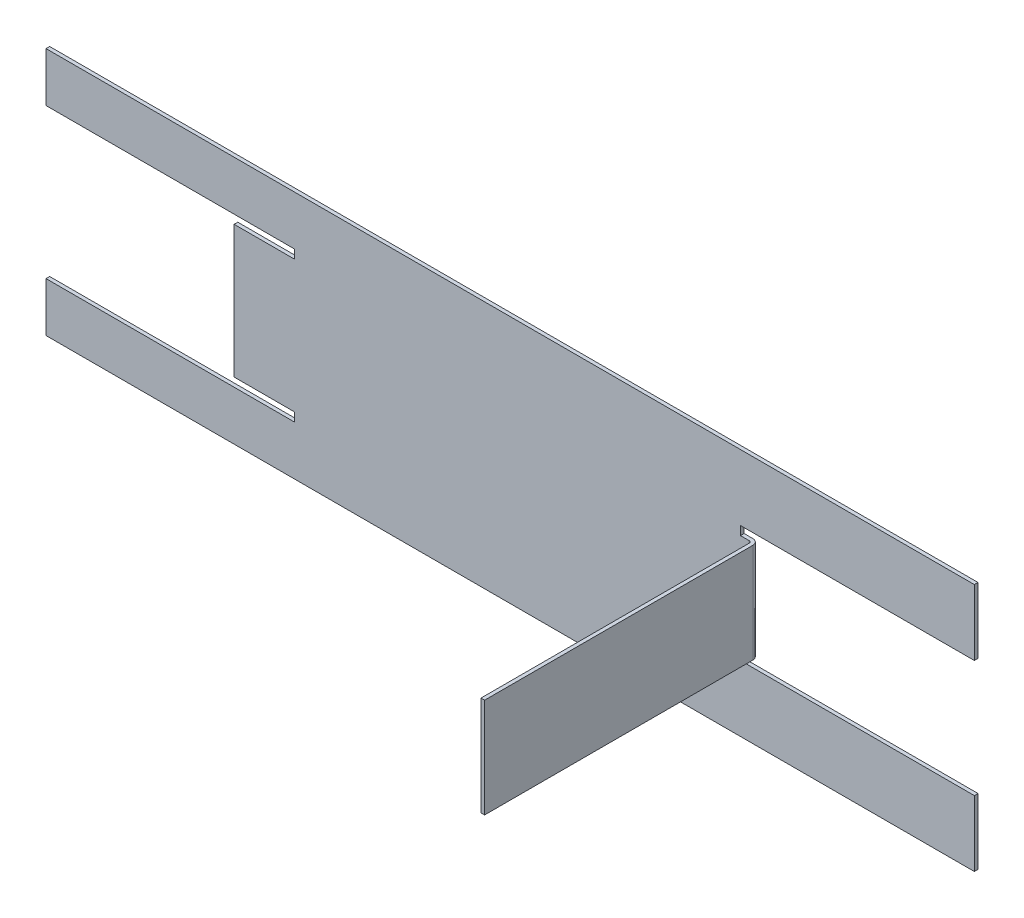
ISO-10303-21;
HEADER;
FILE_DESCRIPTION(('STEP AP214'),'2;1');
FILE_NAME('part.step','',(''),(''),'','','');
FILE_SCHEMA(('AUTOMOTIVE_DESIGN { 1 0 10303 214 1 1 1 1 }'));
ENDSEC;
DATA;
#1=APPLICATION_CONTEXT('core data for automotive mechanical design processes');
#2=APPLICATION_PROTOCOL_DEFINITION('international standard','automotive_design',2000,#1);
#3=PRODUCT_CONTEXT('',#1,'mechanical');
#4=PRODUCT('Part','Part','',(#3));
#5=PRODUCT_RELATED_PRODUCT_CATEGORY('part','',(#4));
#6=PRODUCT_DEFINITION_FORMATION('','',#4);
#7=PRODUCT_DEFINITION_CONTEXT('part definition',#1,'design');
#8=PRODUCT_DEFINITION('design','',#6,#7);
#9=PRODUCT_DEFINITION_SHAPE('','',#8);
#10=(LENGTH_UNIT() NAMED_UNIT(*) SI_UNIT(.MILLI.,.METRE.));
#11=(NAMED_UNIT(*) PLANE_ANGLE_UNIT() SI_UNIT($,.RADIAN.));
#12=(NAMED_UNIT(*) SI_UNIT($,.STERADIAN.) SOLID_ANGLE_UNIT());
#13=UNCERTAINTY_MEASURE_WITH_UNIT(LENGTH_MEASURE(1.E-05),#10,'distance_accuracy_value','');
#14=(GEOMETRIC_REPRESENTATION_CONTEXT(3) GLOBAL_UNCERTAINTY_ASSIGNED_CONTEXT((#13)) GLOBAL_UNIT_ASSIGNED_CONTEXT((#10,
#11,#12)) REPRESENTATION_CONTEXT('',''));
#15=CARTESIAN_POINT('',(0.,0.,0.));
#16=DIRECTION('',(0.,0.,1.));
#17=DIRECTION('',(1.,0.,0.));
#18=AXIS2_PLACEMENT_3D('',#15,#16,#17);
#19=CARTESIAN_POINT('',(0.,0.,-0.5));
#20=DIRECTION('',(0.,0.,-1.));
#21=DIRECTION('',(-1.,0.,0.));
#22=AXIS2_PLACEMENT_3D('',#19,#20,#21);
#23=PLANE('',#22);
#24=DIRECTION('',(-1.,0.,0.));
#25=VECTOR('',#24,1.);
#26=CARTESIAN_POINT('',(0.,6.8,-0.5));
#27=LINE('',#26,#25);
#28=CARTESIAN_POINT('',(31.5,6.8,-0.5));
#29=VERTEX_POINT('',#28);
#30=CARTESIAN_POINT('',(32.7,6.8,-0.499999999999999));
#31=VERTEX_POINT('',#30);
#32=EDGE_CURVE('E365',#29,#31,#27,.F.);
#33=ORIENTED_EDGE('',*,*,#32,.T.);
#34=DIRECTION('',(0.,1.,0.));
#35=VECTOR('',#34,1.);
#36=CARTESIAN_POINT('',(32.7,6.8,-0.499999999999999));
#37=LINE('',#36,#35);
#38=CARTESIAN_POINT('',(32.7,-6.8,-0.5));
#39=VERTEX_POINT('',#38);
#40=EDGE_CURVE('E334',#31,#39,#37,.F.);
#41=ORIENTED_EDGE('',*,*,#40,.T.);
#42=DIRECTION('',(-1.,0.,0.));
#43=VECTOR('',#42,1.);
#44=CARTESIAN_POINT('',(0.,-6.8,-0.5));
#45=LINE('',#44,#43);
#46=CARTESIAN_POINT('',(31.5,-6.8,-0.5));
#47=VERTEX_POINT('',#46);
#48=EDGE_CURVE('E385',#39,#47,#45,.T.);
#49=ORIENTED_EDGE('',*,*,#48,.T.);
#50=DIRECTION('',(0.,1.,0.));
#51=VECTOR('',#50,1.);
#52=CARTESIAN_POINT('',(31.5,0.,-0.5));
#53=LINE('',#52,#51);
#54=CARTESIAN_POINT('',(31.5,-8.,-0.5));
#55=VERTEX_POINT('',#54);
#56=EDGE_CURVE('E381',#47,#55,#53,.F.);
#57=ORIENTED_EDGE('',*,*,#56,.T.);
#58=DIRECTION('',(1.,0.,0.));
#59=VECTOR('',#58,1.);
#60=CARTESIAN_POINT('',(0.,-8.,-0.499999999999999));
#61=LINE('',#60,#59);
#62=CARTESIAN_POINT('',(63.5,-8.,-0.499999999999999));
#63=VERTEX_POINT('',#62);
#64=EDGE_CURVE('E409',#55,#63,#61,.T.);
#65=ORIENTED_EDGE('',*,*,#64,.T.);
#66=DIRECTION('',(0.,1.,0.));
#67=VECTOR('',#66,1.);
#68=CARTESIAN_POINT('',(63.5,17.,-0.5));
#69=LINE('',#68,#67);
#70=CARTESIAN_POINT('',(63.5,-17.,-0.5));
#71=VERTEX_POINT('',#70);
#72=EDGE_CURVE('E264',#71,#63,#69,.T.);
#73=ORIENTED_EDGE('',*,*,#72,.F.);
#74=DIRECTION('',(1.,0.,0.));
#75=VECTOR('',#74,1.);
#76=CARTESIAN_POINT('',(-63.5,-17.,-0.5));
#77=LINE('',#76,#75);
#78=CARTESIAN_POINT('',(-63.5,-17.,-0.5));
#79=VERTEX_POINT('',#78);
#80=EDGE_CURVE('E274',#79,#71,#77,.T.);
#81=ORIENTED_EDGE('',*,*,#80,.F.);
#82=DIRECTION('',(0.,-1.,0.));
#83=VECTOR('',#82,1.);
#84=CARTESIAN_POINT('',(-63.5,17.,-0.5));
#85=LINE('',#84,#83);
#86=CARTESIAN_POINT('',(-63.5,-10.25,-0.499999999999999));
#87=VERTEX_POINT('',#86);
#88=EDGE_CURVE('E429',#87,#79,#85,.T.);
#89=ORIENTED_EDGE('',*,*,#88,.F.);
#90=DIRECTION('',(-1.,0.,0.));
#91=VECTOR('',#90,1.);
#92=CARTESIAN_POINT('',(0.,-10.25,-0.499999999999999));
#93=LINE('',#92,#91);
#94=CARTESIAN_POINT('',(-29.5,-10.25,-0.5));
#95=VERTEX_POINT('',#94);
#96=EDGE_CURVE('E418',#95,#87,#93,.T.);
#97=ORIENTED_EDGE('',*,*,#96,.F.);
#98=DIRECTION('',(0.,1.,0.));
#99=VECTOR('',#98,1.);
#100=CARTESIAN_POINT('',(-29.5,0.,-0.5));
#101=LINE('',#100,#99);
#102=CARTESIAN_POINT('',(-29.5,-9.05,-0.5));
#103=VERTEX_POINT('',#102);
#104=EDGE_CURVE('E400',#95,#103,#101,.T.);
#105=ORIENTED_EDGE('',*,*,#104,.T.);
#106=DIRECTION('',(-1.,0.,0.));
#107=VECTOR('',#106,1.);
#108=CARTESIAN_POINT('',(0.,-9.05,-0.5));
#109=LINE('',#108,#107);
#110=CARTESIAN_POINT('',(-37.7639379797372,-9.05,-0.500000000000046));
#111=VERTEX_POINT('',#110);
#112=EDGE_CURVE('E397',#103,#111,#109,.T.);
#113=ORIENTED_EDGE('',*,*,#112,.T.);
#114=DIRECTION('',(0.,1.,0.));
#115=VECTOR('',#114,1.);
#116=CARTESIAN_POINT('',(-37.7639379797372,0.,-0.500000000000046));
#117=LINE('',#116,#115);
#118=CARTESIAN_POINT('',(-37.7639379797372,9.05,-0.500000000000046));
#119=VERTEX_POINT('',#118);
#120=EDGE_CURVE('E302',#111,#119,#117,.T.);
#121=ORIENTED_EDGE('',*,*,#120,.T.);
#122=DIRECTION('',(-1.,0.,0.));
#123=VECTOR('',#122,1.);
#124=CARTESIAN_POINT('',(0.,9.05,-0.5));
#125=LINE('',#124,#123);
#126=CARTESIAN_POINT('',(-29.5,9.05,-0.5));
#127=VERTEX_POINT('',#126);
#128=EDGE_CURVE('E353',#119,#127,#125,.F.);
#129=ORIENTED_EDGE('',*,*,#128,.T.);
#130=DIRECTION('',(0.,1.,0.));
#131=VECTOR('',#130,1.);
#132=CARTESIAN_POINT('',(-29.5,0.,-0.5));
#133=LINE('',#132,#131);
#134=CARTESIAN_POINT('',(-29.5,10.25,-0.5));
#135=VERTEX_POINT('',#134);
#136=EDGE_CURVE('E349',#127,#135,#133,.T.);
#137=ORIENTED_EDGE('',*,*,#136,.T.);
#138=DIRECTION('',(1.,0.,0.));
#139=VECTOR('',#138,1.);
#140=CARTESIAN_POINT('',(0.,10.25,-0.500000000000001));
#141=LINE('',#140,#139);
#142=CARTESIAN_POINT('',(-63.5,10.25,-0.500000000000001));
#143=VERTEX_POINT('',#142);
#144=EDGE_CURVE('E421',#143,#135,#141,.T.);
#145=ORIENTED_EDGE('',*,*,#144,.F.);
#146=CARTESIAN_POINT('',(-63.5,17.,-0.5));
#147=VERTEX_POINT('',#146);
#148=EDGE_CURVE('E279',#147,#143,#85,.T.);
#149=ORIENTED_EDGE('',*,*,#148,.F.);
#150=DIRECTION('',(-1.,0.,0.));
#151=VECTOR('',#150,1.);
#152=CARTESIAN_POINT('',(-63.5,17.,-0.5));
#153=LINE('',#152,#151);
#154=CARTESIAN_POINT('',(63.5,17.,-0.5));
#155=VERTEX_POINT('',#154);
#156=EDGE_CURVE('E271',#155,#147,#153,.T.);
#157=ORIENTED_EDGE('',*,*,#156,.F.);
#158=CARTESIAN_POINT('',(63.5,8.,-0.500000000000001));
#159=VERTEX_POINT('',#158);
#160=EDGE_CURVE('E255',#159,#155,#69,.T.);
#161=ORIENTED_EDGE('',*,*,#160,.F.);
#162=DIRECTION('',(1.,0.,0.));
#163=VECTOR('',#162,1.);
#164=CARTESIAN_POINT('',(0.,8.,-0.500000000000001));
#165=LINE('',#164,#163);
#166=CARTESIAN_POINT('',(31.5,8.,-0.5));
#167=VERTEX_POINT('',#166);
#168=EDGE_CURVE('E414',#167,#159,#165,.T.);
#169=ORIENTED_EDGE('',*,*,#168,.F.);
#170=DIRECTION('',(0.,1.,0.));
#171=VECTOR('',#170,1.);
#172=CARTESIAN_POINT('',(31.5,0.,-0.5));
#173=LINE('',#172,#171);
#174=EDGE_CURVE('E368',#167,#29,#173,.F.);
#175=ORIENTED_EDGE('',*,*,#174,.T.);
#176=EDGE_LOOP('',(#33,#41,#49,#57,#65,#73,#81,#89,#97,#105,#113,#121,#129,#137,#145,#149,#157,
#161,#169,#175));
#177=FACE_BOUND('',#176,.T.);
#178=ADVANCED_FACE('F94',(#177),#23,.T.);
#179=CARTESIAN_POINT('',(0.,0.,0.));
#180=DIRECTION('',(0.,0.,-1.));
#181=DIRECTION('',(-1.,0.,0.));
#182=AXIS2_PLACEMENT_3D('',#179,#180,#181);
#183=PLANE('',#182);
#184=DIRECTION('',(0.,1.,0.));
#185=VECTOR('',#184,1.);
#186=CARTESIAN_POINT('',(32.7,6.8,0.));
#187=LINE('',#186,#185);
#188=CARTESIAN_POINT('',(32.7,6.8,0.));
#189=VERTEX_POINT('',#188);
#190=CARTESIAN_POINT('',(32.7,-6.8,0.));
#191=VERTEX_POINT('',#190);
#192=EDGE_CURVE('E346',#189,#191,#187,.F.);
#193=ORIENTED_EDGE('',*,*,#192,.F.);
#194=DIRECTION('',(1.,0.,0.));
#195=VECTOR('',#194,1.);
#196=CARTESIAN_POINT('',(33.5,6.8,0.));
#197=LINE('',#196,#195);
#198=CARTESIAN_POINT('',(31.5,6.8,0.));
#199=VERTEX_POINT('',#198);
#200=EDGE_CURVE('E371',#199,#189,#197,.T.);
#201=ORIENTED_EDGE('',*,*,#200,.F.);
#202=DIRECTION('',(0.,-1.,0.));
#203=VECTOR('',#202,1.);
#204=CARTESIAN_POINT('',(31.5,8.,0.));
#205=LINE('',#204,#203);
#206=CARTESIAN_POINT('',(31.5,8.,0.));
#207=VERTEX_POINT('',#206);
#208=EDGE_CURVE('E364',#207,#199,#205,.T.);
#209=ORIENTED_EDGE('',*,*,#208,.F.);
#210=DIRECTION('',(1.,0.,0.));
#211=VECTOR('',#210,1.);
#212=CARTESIAN_POINT('',(0.,8.,0.));
#213=LINE('',#212,#211);
#214=CARTESIAN_POINT('',(63.5,8.,0.));
#215=VERTEX_POINT('',#214);
#216=EDGE_CURVE('E102',#207,#215,#213,.T.);
#217=ORIENTED_EDGE('',*,*,#216,.T.);
#218=DIRECTION('',(0.,1.,0.));
#219=VECTOR('',#218,1.);
#220=CARTESIAN_POINT('',(63.5,17.,0.));
#221=LINE('',#220,#219);
#222=CARTESIAN_POINT('',(63.5,17.,0.));
#223=VERTEX_POINT('',#222);
#224=EDGE_CURVE('E425',#215,#223,#221,.T.);
#225=ORIENTED_EDGE('',*,*,#224,.T.);
#226=DIRECTION('',(-1.,0.,0.));
#227=VECTOR('',#226,1.);
#228=CARTESIAN_POINT('',(-63.5,17.,0.));
#229=LINE('',#228,#227);
#230=CARTESIAN_POINT('',(-63.5,17.,0.));
#231=VERTEX_POINT('',#230);
#232=EDGE_CURVE('E273',#223,#231,#229,.T.);
#233=ORIENTED_EDGE('',*,*,#232,.T.);
#234=DIRECTION('',(0.,-1.,0.));
#235=VECTOR('',#234,1.);
#236=CARTESIAN_POINT('',(-63.5,17.,0.));
#237=LINE('',#236,#235);
#238=CARTESIAN_POINT('',(-63.5,10.25,0.));
#239=VERTEX_POINT('',#238);
#240=EDGE_CURVE('E265',#231,#239,#237,.T.);
#241=ORIENTED_EDGE('',*,*,#240,.T.);
#242=DIRECTION('',(1.,0.,0.));
#243=VECTOR('',#242,1.);
#244=CARTESIAN_POINT('',(0.,10.25,0.));
#245=LINE('',#244,#243);
#246=CARTESIAN_POINT('',(-29.5,10.25,0.));
#247=VERTEX_POINT('',#246);
#248=EDGE_CURVE('E117',#239,#247,#245,.T.);
#249=ORIENTED_EDGE('',*,*,#248,.T.);
#250=DIRECTION('',(0.,1.,0.));
#251=VECTOR('',#250,1.);
#252=CARTESIAN_POINT('',(-29.5,10.25,0.));
#253=LINE('',#252,#251);
#254=CARTESIAN_POINT('',(-29.5,9.05,0.));
#255=VERTEX_POINT('',#254);
#256=EDGE_CURVE('E355',#255,#247,#253,.T.);
#257=ORIENTED_EDGE('',*,*,#256,.F.);
#258=DIRECTION('',(1.,0.,0.));
#259=VECTOR('',#258,1.);
#260=CARTESIAN_POINT('',(-31.5,9.05,0.));
#261=LINE('',#260,#259);
#262=CARTESIAN_POINT('',(-37.7639379797372,9.05,0.));
#263=VERTEX_POINT('',#262);
#264=EDGE_CURVE('E341',#263,#255,#261,.T.);
#265=ORIENTED_EDGE('',*,*,#264,.F.);
#266=DIRECTION('',(0.,-1.,0.));
#267=VECTOR('',#266,1.);
#268=CARTESIAN_POINT('',(-37.7639379797372,9.05,0.));
#269=LINE('',#268,#267);
#270=CARTESIAN_POINT('',(-37.7639379797372,-9.05,0.));
#271=VERTEX_POINT('',#270);
#272=EDGE_CURVE('E289',#271,#263,#269,.F.);
#273=ORIENTED_EDGE('',*,*,#272,.F.);
#274=DIRECTION('',(-1.,0.,0.));
#275=VECTOR('',#274,1.);
#276=CARTESIAN_POINT('',(-31.5,-9.05,0.));
#277=LINE('',#276,#275);
#278=CARTESIAN_POINT('',(-29.5,-9.05,0.));
#279=VERTEX_POINT('',#278);
#280=EDGE_CURVE('E403',#279,#271,#277,.T.);
#281=ORIENTED_EDGE('',*,*,#280,.F.);
#282=DIRECTION('',(0.,1.,0.));
#283=VECTOR('',#282,1.);
#284=CARTESIAN_POINT('',(-29.5,-10.25,0.));
#285=LINE('',#284,#283);
#286=CARTESIAN_POINT('',(-29.5,-10.25,0.));
#287=VERTEX_POINT('',#286);
#288=EDGE_CURVE('E396',#287,#279,#285,.T.);
#289=ORIENTED_EDGE('',*,*,#288,.F.);
#290=DIRECTION('',(-1.,0.,0.));
#291=VECTOR('',#290,1.);
#292=CARTESIAN_POINT('',(0.,-10.25,0.));
#293=LINE('',#292,#291);
#294=CARTESIAN_POINT('',(-63.5,-10.25,0.));
#295=VERTEX_POINT('',#294);
#296=EDGE_CURVE('E428',#287,#295,#293,.T.);
#297=ORIENTED_EDGE('',*,*,#296,.T.);
#298=CARTESIAN_POINT('',(-63.5,-17.,0.));
#299=VERTEX_POINT('',#298);
#300=EDGE_CURVE('E432',#295,#299,#237,.T.);
#301=ORIENTED_EDGE('',*,*,#300,.T.);
#302=DIRECTION('',(1.,0.,0.));
#303=VECTOR('',#302,1.);
#304=CARTESIAN_POINT('',(-63.5,-17.,0.));
#305=LINE('',#304,#303);
#306=CARTESIAN_POINT('',(63.5,-17.,0.));
#307=VERTEX_POINT('',#306);
#308=EDGE_CURVE('E290',#299,#307,#305,.T.);
#309=ORIENTED_EDGE('',*,*,#308,.T.);
#310=CARTESIAN_POINT('',(63.5,-8.,0.));
#311=VERTEX_POINT('',#310);
#312=EDGE_CURVE('E433',#307,#311,#221,.T.);
#313=ORIENTED_EDGE('',*,*,#312,.T.);
#314=DIRECTION('',(1.,0.,0.));
#315=VECTOR('',#314,1.);
#316=CARTESIAN_POINT('',(0.,-8.,0.));
#317=LINE('',#316,#315);
#318=CARTESIAN_POINT('',(31.5,-8.,0.));
#319=VERTEX_POINT('',#318);
#320=EDGE_CURVE('E13',#319,#311,#317,.T.);
#321=ORIENTED_EDGE('',*,*,#320,.F.);
#322=DIRECTION('',(0.,-1.,0.));
#323=VECTOR('',#322,1.);
#324=CARTESIAN_POINT('',(31.5,-8.,0.));
#325=LINE('',#324,#323);
#326=CARTESIAN_POINT('',(31.5,-6.8,0.));
#327=VERTEX_POINT('',#326);
#328=EDGE_CURVE('E387',#327,#319,#325,.T.);
#329=ORIENTED_EDGE('',*,*,#328,.F.);
#330=DIRECTION('',(-1.,0.,0.));
#331=VECTOR('',#330,1.);
#332=CARTESIAN_POINT('',(33.5,-6.8,0.));
#333=LINE('',#332,#331);
#334=EDGE_CURVE('E378',#191,#327,#333,.T.);
#335=ORIENTED_EDGE('',*,*,#334,.F.);
#336=EDGE_LOOP('',(#193,#201,#209,#217,#225,#233,#241,#249,#257,#265,#273,#281,#289,#297,#301,
#309,#313,#321,#329,#335));
#337=FACE_BOUND('',#336,.T.);
#338=ADVANCED_FACE('F96',(#337),#183,.F.);
#339=CARTESIAN_POINT('',(33.5,6.8,0.));
#340=DIRECTION('',(0.,1.,0.));
#341=DIRECTION('',(1.,0.,0.));
#342=AXIS2_PLACEMENT_3D('',#339,#340,#341);
#343=PLANE('',#342);
#344=ORIENTED_EDGE('',*,*,#200,.T.);
#345=CARTESIAN_POINT('',(32.7,6.8,0.300000000000003));
#346=DIRECTION('',(0.,1.,0.));
#347=DIRECTION('',(0.,0.,1.));
#348=AXIS2_PLACEMENT_3D('',#345,#346,#347);
#349=CIRCLE('',#348,0.300000000000002);
#350=CARTESIAN_POINT('',(33.,6.8,0.300000000000002));
#351=VERTEX_POINT('',#350);
#352=EDGE_CURVE('E313',#351,#189,#349,.T.);
#353=ORIENTED_EDGE('',*,*,#352,.F.);
#354=DIRECTION('',(0.,0.,-1.));
#355=VECTOR('',#354,1.);
#356=CARTESIAN_POINT('',(33.0000000000001,6.8,37.));
#357=LINE('',#356,#355);
#358=CARTESIAN_POINT('',(33.0000000000001,6.8,37.));
#359=VERTEX_POINT('',#358);
#360=EDGE_CURVE('E329',#351,#359,#357,.F.);
#361=ORIENTED_EDGE('',*,*,#360,.T.);
#362=DIRECTION('',(-1.,0.,0.));
#363=VECTOR('',#362,1.);
#364=CARTESIAN_POINT('',(33.5000000000001,6.8,37.));
#365=LINE('',#364,#363);
#366=CARTESIAN_POINT('',(33.5000000000001,6.8,37.));
#367=VERTEX_POINT('',#366);
#368=EDGE_CURVE('E310',#367,#359,#365,.T.);
#369=ORIENTED_EDGE('',*,*,#368,.F.);
#370=DIRECTION('',(0.,0.,1.));
#371=VECTOR('',#370,1.);
#372=CARTESIAN_POINT('',(33.5,6.8,-1.2031643447335E-13));
#373=LINE('',#372,#371);
#374=CARTESIAN_POINT('',(33.5,6.8,0.3));
#375=VERTEX_POINT('',#374);
#376=EDGE_CURVE('E322',#375,#367,#373,.T.);
#377=ORIENTED_EDGE('',*,*,#376,.F.);
#378=CARTESIAN_POINT('',(32.7,6.8,0.300000000000003));
#379=DIRECTION('',(0.,1.,0.));
#380=DIRECTION('',(0.,0.,1.));
#381=AXIS2_PLACEMENT_3D('',#378,#379,#380);
#382=CIRCLE('',#381,0.800000000000002);
#383=EDGE_CURVE('E338',#375,#31,#382,.T.);
#384=ORIENTED_EDGE('',*,*,#383,.T.);
#385=ORIENTED_EDGE('',*,*,#32,.F.);
#386=DIRECTION('',(0.,0.,1.));
#387=VECTOR('',#386,1.);
#388=CARTESIAN_POINT('',(31.5,6.8,0.));
#389=LINE('',#388,#387);
#390=EDGE_CURVE('E375',#199,#29,#389,.F.);
#391=ORIENTED_EDGE('',*,*,#390,.F.);
#392=EDGE_LOOP('',(#344,#353,#361,#369,#377,#384,#385,#391));
#393=FACE_BOUND('',#392,.T.);
#394=ADVANCED_FACE('F452',(#393),#343,.T.);
#395=CARTESIAN_POINT('',(-31.5,-9.05,0.));
#396=DIRECTION('',(0.,-1.,0.));
#397=DIRECTION('',(-1.,0.,0.));
#398=AXIS2_PLACEMENT_3D('',#395,#396,#397);
#399=PLANE('',#398);
#400=ORIENTED_EDGE('',*,*,#280,.T.);
#401=DIRECTION('',(0.,0.,1.));
#402=VECTOR('',#401,1.);
#403=CARTESIAN_POINT('',(-37.7639379797372,-9.05,-0.500000000000046));
#404=LINE('',#403,#402);
#405=EDGE_CURVE('E305',#111,#271,#404,.T.);
#406=ORIENTED_EDGE('',*,*,#405,.F.);
#407=ORIENTED_EDGE('',*,*,#112,.F.);
#408=DIRECTION('',(0.,0.,1.));
#409=VECTOR('',#408,1.);
#410=CARTESIAN_POINT('',(-29.5,-9.05,0.));
#411=LINE('',#410,#409);
#412=EDGE_CURVE('E406',#279,#103,#411,.F.);
#413=ORIENTED_EDGE('',*,*,#412,.F.);
#414=EDGE_LOOP('',(#400,#406,#407,#413));
#415=FACE_BOUND('',#414,.T.);
#416=ADVANCED_FACE('F499',(#415),#399,.T.);
#417=CARTESIAN_POINT('',(63.5,17.,-0.5));
#418=DIRECTION('',(1.,0.,0.));
#419=DIRECTION('',(0.,1.,0.));
#420=AXIS2_PLACEMENT_3D('',#417,#418,#419);
#421=PLANE('',#420);
#422=ORIENTED_EDGE('',*,*,#72,.T.);
#423=DIRECTION('',(0.,0.,-1.));
#424=VECTOR('',#423,1.);
#425=CARTESIAN_POINT('',(63.5,-8.,2.82455275013142));
#426=LINE('',#425,#424);
#427=EDGE_CURVE('E416',#311,#63,#426,.T.);
#428=ORIENTED_EDGE('',*,*,#427,.F.);
#429=ORIENTED_EDGE('',*,*,#312,.F.);
#430=DIRECTION('',(0.,0.,1.));
#431=VECTOR('',#430,1.);
#432=CARTESIAN_POINT('',(63.5,-17.,-0.5));
#433=LINE('',#432,#431);
#434=EDGE_CURVE('E293',#71,#307,#433,.T.);
#435=ORIENTED_EDGE('',*,*,#434,.F.);
#436=EDGE_LOOP('',(#422,#428,#429,#435));
#437=FACE_BOUND('',#436,.T.);
#438=ADVANCED_FACE('F478',(#437),#421,.T.);
#439=CARTESIAN_POINT('',(-63.5,17.,-0.5));
#440=DIRECTION('',(-1.,0.,0.));
#441=DIRECTION('',(0.,0.,1.));
#442=AXIS2_PLACEMENT_3D('',#439,#440,#441);
#443=PLANE('',#442);
#444=DIRECTION('',(0.,0.,-1.));
#445=VECTOR('',#444,1.);
#446=CARTESIAN_POINT('',(-63.5,10.25,2.82455275013142));
#447=LINE('',#446,#445);
#448=EDGE_CURVE('E423',#239,#143,#447,.T.);
#449=ORIENTED_EDGE('',*,*,#448,.F.);
#450=ORIENTED_EDGE('',*,*,#240,.F.);
#451=DIRECTION('',(0.,0.,1.));
#452=VECTOR('',#451,1.);
#453=CARTESIAN_POINT('',(-63.5,17.,-0.5));
#454=LINE('',#453,#452);
#455=EDGE_CURVE('E281',#147,#231,#454,.T.);
#456=ORIENTED_EDGE('',*,*,#455,.F.);
#457=ORIENTED_EDGE('',*,*,#148,.T.);
#458=EDGE_LOOP('',(#449,#450,#456,#457));
#459=FACE_BOUND('',#458,.T.);
#460=ADVANCED_FACE('F512',(#459),#443,.T.);
#461=DIRECTION('',(0.,0.,-1.));
#462=VECTOR('',#461,1.);
#463=CARTESIAN_POINT('',(-63.5,-10.25,2.82455275013142));
#464=LINE('',#463,#462);
#465=EDGE_CURVE('E109',#295,#87,#464,.T.);
#466=ORIENTED_EDGE('',*,*,#465,.T.);
#467=ORIENTED_EDGE('',*,*,#88,.T.);
#468=DIRECTION('',(0.,0.,1.));
#469=VECTOR('',#468,1.);
#470=CARTESIAN_POINT('',(-63.5,-17.,-0.5));
#471=LINE('',#470,#469);
#472=EDGE_CURVE('E286',#79,#299,#471,.T.);
#473=ORIENTED_EDGE('',*,*,#472,.T.);
#474=ORIENTED_EDGE('',*,*,#300,.F.);
#475=EDGE_LOOP('',(#466,#467,#473,#474));
#476=FACE_BOUND('',#475,.T.);
#477=ADVANCED_FACE('F486',(#476),#443,.T.);
#478=DIRECTION('',(0.,0.,-1.));
#479=VECTOR('',#478,1.);
#480=CARTESIAN_POINT('',(63.5,8.,2.82455275013142));
#481=LINE('',#480,#479);
#482=EDGE_CURVE('E261',#215,#159,#481,.T.);
#483=ORIENTED_EDGE('',*,*,#482,.T.);
#484=ORIENTED_EDGE('',*,*,#160,.T.);
#485=DIRECTION('',(0.,0.,1.));
#486=VECTOR('',#485,1.);
#487=CARTESIAN_POINT('',(63.5,17.,-0.5));
#488=LINE('',#487,#486);
#489=EDGE_CURVE('E259',#155,#223,#488,.T.);
#490=ORIENTED_EDGE('',*,*,#489,.T.);
#491=ORIENTED_EDGE('',*,*,#224,.F.);
#492=EDGE_LOOP('',(#483,#484,#490,#491));
#493=FACE_BOUND('',#492,.T.);
#494=ADVANCED_FACE('F257',(#493),#421,.T.);
#495=CARTESIAN_POINT('',(0.,10.25,2.82455275013142));
#496=DIRECTION('',(0.,1.,0.));
#497=DIRECTION('',(0.,0.,1.));
#498=AXIS2_PLACEMENT_3D('',#495,#496,#497);
#499=PLANE('',#498);
#500=ORIENTED_EDGE('',*,*,#448,.T.);
#501=ORIENTED_EDGE('',*,*,#144,.T.);
#502=DIRECTION('',(0.,0.,1.));
#503=VECTOR('',#502,1.);
#504=CARTESIAN_POINT('',(-29.5,10.25,0.));
#505=LINE('',#504,#503);
#506=EDGE_CURVE('E352',#247,#135,#505,.F.);
#507=ORIENTED_EDGE('',*,*,#506,.F.);
#508=ORIENTED_EDGE('',*,*,#248,.F.);
#509=EDGE_LOOP('',(#500,#501,#507,#508));
#510=FACE_BOUND('',#509,.T.);
#511=ADVANCED_FACE('F510',(#510),#499,.F.);
#512=CARTESIAN_POINT('',(0.,-10.25,2.82455275013142));
#513=DIRECTION('',(0.,-1.,0.));
#514=DIRECTION('',(0.,0.,-1.));
#515=AXIS2_PLACEMENT_3D('',#512,#513,#514);
#516=PLANE('',#515);
#517=ORIENTED_EDGE('',*,*,#296,.F.);
#518=DIRECTION('',(0.,0.,1.));
#519=VECTOR('',#518,1.);
#520=CARTESIAN_POINT('',(-29.5,-10.25,0.));
#521=LINE('',#520,#519);
#522=EDGE_CURVE('E399',#287,#95,#521,.F.);
#523=ORIENTED_EDGE('',*,*,#522,.T.);
#524=ORIENTED_EDGE('',*,*,#96,.T.);
#525=ORIENTED_EDGE('',*,*,#465,.F.);
#526=EDGE_LOOP('',(#517,#523,#524,#525));
#527=FACE_BOUND('',#526,.T.);
#528=ADVANCED_FACE('F491',(#527),#516,.F.);
#529=CARTESIAN_POINT('',(0.,-8.,2.82455275013142));
#530=DIRECTION('',(0.,1.,0.));
#531=DIRECTION('',(0.,0.,1.));
#532=AXIS2_PLACEMENT_3D('',#529,#530,#531);
#533=PLANE('',#532);
#534=ORIENTED_EDGE('',*,*,#320,.T.);
#535=ORIENTED_EDGE('',*,*,#427,.T.);
#536=ORIENTED_EDGE('',*,*,#64,.F.);
#537=DIRECTION('',(0.,0.,1.));
#538=VECTOR('',#537,1.);
#539=CARTESIAN_POINT('',(31.5,-8.,0.));
#540=LINE('',#539,#538);
#541=EDGE_CURVE('E384',#319,#55,#540,.F.);
#542=ORIENTED_EDGE('',*,*,#541,.F.);
#543=EDGE_LOOP('',(#534,#535,#536,#542));
#544=FACE_BOUND('',#543,.T.);
#545=ADVANCED_FACE('F473',(#544),#533,.T.);
#546=CARTESIAN_POINT('',(0.,8.,2.82455275013142));
#547=DIRECTION('',(0.,1.,0.));
#548=DIRECTION('',(0.,0.,1.));
#549=AXIS2_PLACEMENT_3D('',#546,#547,#548);
#550=PLANE('',#549);
#551=ORIENTED_EDGE('',*,*,#216,.F.);
#552=DIRECTION('',(0.,0.,1.));
#553=VECTOR('',#552,1.);
#554=CARTESIAN_POINT('',(31.5,8.,0.));
#555=LINE('',#554,#553);
#556=EDGE_CURVE('E367',#207,#167,#555,.F.);
#557=ORIENTED_EDGE('',*,*,#556,.T.);
#558=ORIENTED_EDGE('',*,*,#168,.T.);
#559=ORIENTED_EDGE('',*,*,#482,.F.);
#560=EDGE_LOOP('',(#551,#557,#558,#559));
#561=FACE_BOUND('',#560,.T.);
#562=ADVANCED_FACE('F445',(#561),#550,.F.);
#563=CARTESIAN_POINT('',(-29.5,-10.25,0.));
#564=DIRECTION('',(-1.,0.,0.));
#565=DIRECTION('',(0.,1.,0.));
#566=AXIS2_PLACEMENT_3D('',#563,#564,#565);
#567=PLANE('',#566);
#568=ORIENTED_EDGE('',*,*,#288,.T.);
#569=ORIENTED_EDGE('',*,*,#412,.T.);
#570=ORIENTED_EDGE('',*,*,#104,.F.);
#571=ORIENTED_EDGE('',*,*,#522,.F.);
#572=EDGE_LOOP('',(#568,#569,#570,#571));
#573=FACE_BOUND('',#572,.T.);
#574=ADVANCED_FACE('F493',(#573),#567,.T.);
#575=CARTESIAN_POINT('',(33.5,-6.8,0.));
#576=DIRECTION('',(0.,-1.,0.));
#577=DIRECTION('',(-1.,0.,0.));
#578=AXIS2_PLACEMENT_3D('',#575,#576,#577);
#579=PLANE('',#578);
#580=ORIENTED_EDGE('',*,*,#48,.F.);
#581=CARTESIAN_POINT('',(32.7,-6.8,0.300000000000003));
#582=DIRECTION('',(0.,1.,0.));
#583=DIRECTION('',(0.,0.,1.));
#584=AXIS2_PLACEMENT_3D('',#581,#582,#583);
#585=CIRCLE('',#584,0.800000000000002);
#586=CARTESIAN_POINT('',(33.5,-6.8,0.3));
#587=VERTEX_POINT('',#586);
#588=EDGE_CURVE('E337',#39,#587,#585,.F.);
#589=ORIENTED_EDGE('',*,*,#588,.T.);
#590=DIRECTION('',(0.,0.,-1.));
#591=VECTOR('',#590,1.);
#592=CARTESIAN_POINT('',(33.5,-6.8,-1.21113469583934E-13));
#593=LINE('',#592,#591);
#594=CARTESIAN_POINT('',(33.5000000000001,-6.8,37.));
#595=VERTEX_POINT('',#594);
#596=EDGE_CURVE('E317',#595,#587,#593,.T.);
#597=ORIENTED_EDGE('',*,*,#596,.F.);
#598=DIRECTION('',(-1.,0.,0.));
#599=VECTOR('',#598,1.);
#600=CARTESIAN_POINT('',(33.5000000000001,-6.8,37.));
#601=LINE('',#600,#599);
#602=CARTESIAN_POINT('',(33.0000000000001,-6.8,37.));
#603=VERTEX_POINT('',#602);
#604=EDGE_CURVE('E314',#595,#603,#601,.T.);
#605=ORIENTED_EDGE('',*,*,#604,.T.);
#606=DIRECTION('',(0.,0.,1.));
#607=VECTOR('',#606,1.);
#608=CARTESIAN_POINT('',(33.,-6.8,0.));
#609=LINE('',#608,#607);
#610=CARTESIAN_POINT('',(33.,-6.8,0.300000000000002));
#611=VERTEX_POINT('',#610);
#612=EDGE_CURVE('E324',#603,#611,#609,.F.);
#613=ORIENTED_EDGE('',*,*,#612,.T.);
#614=CARTESIAN_POINT('',(32.7,-6.8,0.300000000000003));
#615=DIRECTION('',(0.,1.,0.));
#616=DIRECTION('',(0.,0.,1.));
#617=AXIS2_PLACEMENT_3D('',#614,#615,#616);
#618=CIRCLE('',#617,0.300000000000002);
#619=EDGE_CURVE('E344',#191,#611,#618,.F.);
#620=ORIENTED_EDGE('',*,*,#619,.F.);
#621=ORIENTED_EDGE('',*,*,#334,.T.);
#622=DIRECTION('',(0.,0.,1.));
#623=VECTOR('',#622,1.);
#624=CARTESIAN_POINT('',(31.5,-6.8,0.));
#625=LINE('',#624,#623);
#626=EDGE_CURVE('E393',#327,#47,#625,.F.);
#627=ORIENTED_EDGE('',*,*,#626,.T.);
#628=EDGE_LOOP('',(#580,#589,#597,#605,#613,#620,#621,#627));
#629=FACE_BOUND('',#628,.T.);
#630=ADVANCED_FACE('F464',(#629),#579,.T.);
#631=CARTESIAN_POINT('',(31.5,-8.,0.));
#632=DIRECTION('',(1.,0.,0.));
#633=DIRECTION('',(0.,-1.,0.));
#634=AXIS2_PLACEMENT_3D('',#631,#632,#633);
#635=PLANE('',#634);
#636=ORIENTED_EDGE('',*,*,#626,.F.);
#637=ORIENTED_EDGE('',*,*,#328,.T.);
#638=ORIENTED_EDGE('',*,*,#541,.T.);
#639=ORIENTED_EDGE('',*,*,#56,.F.);
#640=EDGE_LOOP('',(#636,#637,#638,#639));
#641=FACE_BOUND('',#640,.T.);
#642=ADVANCED_FACE('F469',(#641),#635,.T.);
#643=CARTESIAN_POINT('',(31.5,8.,0.));
#644=DIRECTION('',(1.,0.,0.));
#645=DIRECTION('',(0.,-1.,0.));
#646=AXIS2_PLACEMENT_3D('',#643,#644,#645);
#647=PLANE('',#646);
#648=ORIENTED_EDGE('',*,*,#208,.T.);
#649=ORIENTED_EDGE('',*,*,#390,.T.);
#650=ORIENTED_EDGE('',*,*,#174,.F.);
#651=ORIENTED_EDGE('',*,*,#556,.F.);
#652=EDGE_LOOP('',(#648,#649,#650,#651));
#653=FACE_BOUND('',#652,.T.);
#654=ADVANCED_FACE('F448',(#653),#647,.T.);
#655=CARTESIAN_POINT('',(-31.5,9.05,0.));
#656=DIRECTION('',(0.,1.,0.));
#657=DIRECTION('',(1.,0.,0.));
#658=AXIS2_PLACEMENT_3D('',#655,#656,#657);
#659=PLANE('',#658);
#660=ORIENTED_EDGE('',*,*,#128,.F.);
#661=DIRECTION('',(0.,0.,1.));
#662=VECTOR('',#661,1.);
#663=CARTESIAN_POINT('',(-37.7639379797372,9.05,-0.500000000000046));
#664=LINE('',#663,#662);
#665=EDGE_CURVE('E298',#119,#263,#664,.T.);
#666=ORIENTED_EDGE('',*,*,#665,.T.);
#667=ORIENTED_EDGE('',*,*,#264,.T.);
#668=DIRECTION('',(0.,0.,1.));
#669=VECTOR('',#668,1.);
#670=CARTESIAN_POINT('',(-29.5,9.05,0.));
#671=LINE('',#670,#669);
#672=EDGE_CURVE('E361',#255,#127,#671,.F.);
#673=ORIENTED_EDGE('',*,*,#672,.T.);
#674=EDGE_LOOP('',(#660,#666,#667,#673));
#675=FACE_BOUND('',#674,.T.);
#676=ADVANCED_FACE('F504',(#675),#659,.T.);
#677=CARTESIAN_POINT('',(-29.5,10.25,0.));
#678=DIRECTION('',(-1.,0.,0.));
#679=DIRECTION('',(0.,1.,0.));
#680=AXIS2_PLACEMENT_3D('',#677,#678,#679);
#681=PLANE('',#680);
#682=ORIENTED_EDGE('',*,*,#672,.F.);
#683=ORIENTED_EDGE('',*,*,#256,.T.);
#684=ORIENTED_EDGE('',*,*,#506,.T.);
#685=ORIENTED_EDGE('',*,*,#136,.F.);
#686=EDGE_LOOP('',(#682,#683,#684,#685));
#687=FACE_BOUND('',#686,.T.);
#688=ADVANCED_FACE('F508',(#687),#681,.T.);
#689=CARTESIAN_POINT('',(32.7,6.8,0.300000000000003));
#690=DIRECTION('',(0.,1.,0.));
#691=DIRECTION('',(1.,0.,0.));
#692=AXIS2_PLACEMENT_3D('',#689,#690,#691);
#693=CYLINDRICAL_SURFACE('',#692,0.800000000000002);
#694=ORIENTED_EDGE('',*,*,#40,.F.);
#695=ORIENTED_EDGE('',*,*,#383,.F.);
#696=DIRECTION('',(0.,1.,0.));
#697=VECTOR('',#696,1.);
#698=CARTESIAN_POINT('',(33.5,-6.8,0.3));
#699=LINE('',#698,#697);
#700=EDGE_CURVE('E331',#375,#587,#699,.F.);
#701=ORIENTED_EDGE('',*,*,#700,.T.);
#702=ORIENTED_EDGE('',*,*,#588,.F.);
#703=EDGE_LOOP('',(#694,#695,#701,#702));
#704=FACE_BOUND('',#703,.T.);
#705=ADVANCED_FACE('F457',(#704),#693,.T.);
#706=CARTESIAN_POINT('',(32.7,6.8,0.300000000000003));
#707=DIRECTION('',(0.,1.,0.));
#708=DIRECTION('',(1.,0.,0.));
#709=AXIS2_PLACEMENT_3D('',#706,#707,#708);
#710=CYLINDRICAL_SURFACE('',#709,0.300000000000002);
#711=ORIENTED_EDGE('',*,*,#192,.T.);
#712=ORIENTED_EDGE('',*,*,#619,.T.);
#713=DIRECTION('',(0.,1.,0.));
#714=VECTOR('',#713,1.);
#715=CARTESIAN_POINT('',(33.,-6.8,0.300000000000002));
#716=LINE('',#715,#714);
#717=EDGE_CURVE('E301',#611,#351,#716,.T.);
#718=ORIENTED_EDGE('',*,*,#717,.T.);
#719=ORIENTED_EDGE('',*,*,#352,.T.);
#720=EDGE_LOOP('',(#711,#712,#718,#719));
#721=FACE_BOUND('',#720,.T.);
#722=ADVANCED_FACE('F554',(#721),#710,.F.);
#723=CARTESIAN_POINT('',(33.5,0.,-1.21113469583934E-13));
#724=DIRECTION('',(-1.,0.,0.));
#725=DIRECTION('',(0.,0.,1.));
#726=AXIS2_PLACEMENT_3D('',#723,#724,#725);
#727=PLANE('',#726);
#728=ORIENTED_EDGE('',*,*,#700,.F.);
#729=ORIENTED_EDGE('',*,*,#376,.T.);
#730=DIRECTION('',(0.,-1.,0.));
#731=VECTOR('',#730,1.);
#732=CARTESIAN_POINT('',(33.5000000000001,0.,37.));
#733=LINE('',#732,#731);
#734=EDGE_CURVE('E320',#367,#595,#733,.T.);
#735=ORIENTED_EDGE('',*,*,#734,.T.);
#736=ORIENTED_EDGE('',*,*,#596,.T.);
#737=EDGE_LOOP('',(#728,#729,#735,#736));
#738=FACE_BOUND('',#737,.T.);
#739=ADVANCED_FACE('F459',(#738),#727,.F.);
#740=CARTESIAN_POINT('',(33.,0.,-1.19367728914512E-13));
#741=DIRECTION('',(-1.,0.,0.));
#742=DIRECTION('',(0.,0.,1.));
#743=AXIS2_PLACEMENT_3D('',#740,#741,#742);
#744=PLANE('',#743);
#745=ORIENTED_EDGE('',*,*,#360,.F.);
#746=ORIENTED_EDGE('',*,*,#717,.F.);
#747=ORIENTED_EDGE('',*,*,#612,.F.);
#748=DIRECTION('',(0.,1.,0.));
#749=VECTOR('',#748,1.);
#750=CARTESIAN_POINT('',(33.0000000000001,-6.8,37.));
#751=LINE('',#750,#749);
#752=EDGE_CURVE('E327',#359,#603,#751,.F.);
#753=ORIENTED_EDGE('',*,*,#752,.F.);
#754=EDGE_LOOP('',(#745,#746,#747,#753));
#755=FACE_BOUND('',#754,.T.);
#756=ADVANCED_FACE('F563',(#755),#744,.T.);
#757=CARTESIAN_POINT('',(33.5000000000001,-6.8,37.));
#758=DIRECTION('',(0.,0.,-1.));
#759=DIRECTION('',(-1.,0.,0.));
#760=AXIS2_PLACEMENT_3D('',#757,#758,#759);
#761=PLANE('',#760);
#762=ORIENTED_EDGE('',*,*,#752,.T.);
#763=ORIENTED_EDGE('',*,*,#604,.F.);
#764=ORIENTED_EDGE('',*,*,#734,.F.);
#765=ORIENTED_EDGE('',*,*,#368,.T.);
#766=EDGE_LOOP('',(#762,#763,#764,#765));
#767=FACE_BOUND('',#766,.T.);
#768=ADVANCED_FACE('F560',(#767),#761,.F.);
#769=CARTESIAN_POINT('',(-37.7639379797372,9.05,-0.500000000000046));
#770=DIRECTION('',(1.,0.,0.));
#771=DIRECTION('',(0.,0.,-1.));
#772=AXIS2_PLACEMENT_3D('',#769,#770,#771);
#773=PLANE('',#772);
#774=ORIENTED_EDGE('',*,*,#272,.T.);
#775=ORIENTED_EDGE('',*,*,#665,.F.);
#776=ORIENTED_EDGE('',*,*,#120,.F.);
#777=ORIENTED_EDGE('',*,*,#405,.T.);
#778=EDGE_LOOP('',(#774,#775,#776,#777));
#779=FACE_BOUND('',#778,.T.);
#780=ADVANCED_FACE('F502',(#779),#773,.F.);
#781=CARTESIAN_POINT('',(-63.5,-17.,-0.5));
#782=DIRECTION('',(0.,-1.,0.));
#783=DIRECTION('',(1.,0.,0.));
#784=AXIS2_PLACEMENT_3D('',#781,#782,#783);
#785=PLANE('',#784);
#786=ORIENTED_EDGE('',*,*,#308,.F.);
#787=ORIENTED_EDGE('',*,*,#472,.F.);
#788=ORIENTED_EDGE('',*,*,#80,.T.);
#789=ORIENTED_EDGE('',*,*,#434,.T.);
#790=EDGE_LOOP('',(#786,#787,#788,#789));
#791=FACE_BOUND('',#790,.T.);
#792=ADVANCED_FACE('F482',(#791),#785,.T.);
#793=CARTESIAN_POINT('',(-63.5,17.,-0.5));
#794=DIRECTION('',(0.,1.,0.));
#795=DIRECTION('',(0.,0.,1.));
#796=AXIS2_PLACEMENT_3D('',#793,#794,#795);
#797=PLANE('',#796);
#798=ORIENTED_EDGE('',*,*,#232,.F.);
#799=ORIENTED_EDGE('',*,*,#489,.F.);
#800=ORIENTED_EDGE('',*,*,#156,.T.);
#801=ORIENTED_EDGE('',*,*,#455,.T.);
#802=EDGE_LOOP('',(#798,#799,#800,#801));
#803=FACE_BOUND('',#802,.T.);
#804=ADVANCED_FACE('F269',(#803),#797,.T.);
#805=CLOSED_SHELL('',(#178,#338,#394,#416,#438,#460,#477,#494,#511,#528,#545,#562,#574,#630,
#642,#654,#676,#688,#705,#722,#739,#756,#768,#780,#792,#804));
#806=MANIFOLD_SOLID_BREP('B2',#805);
#807=ADVANCED_BREP_SHAPE_REPRESENTATION('',(#18,#806),#14);
#808=SHAPE_DEFINITION_REPRESENTATION(#9,#807);
ENDSEC;
END-ISO-10303-21;
